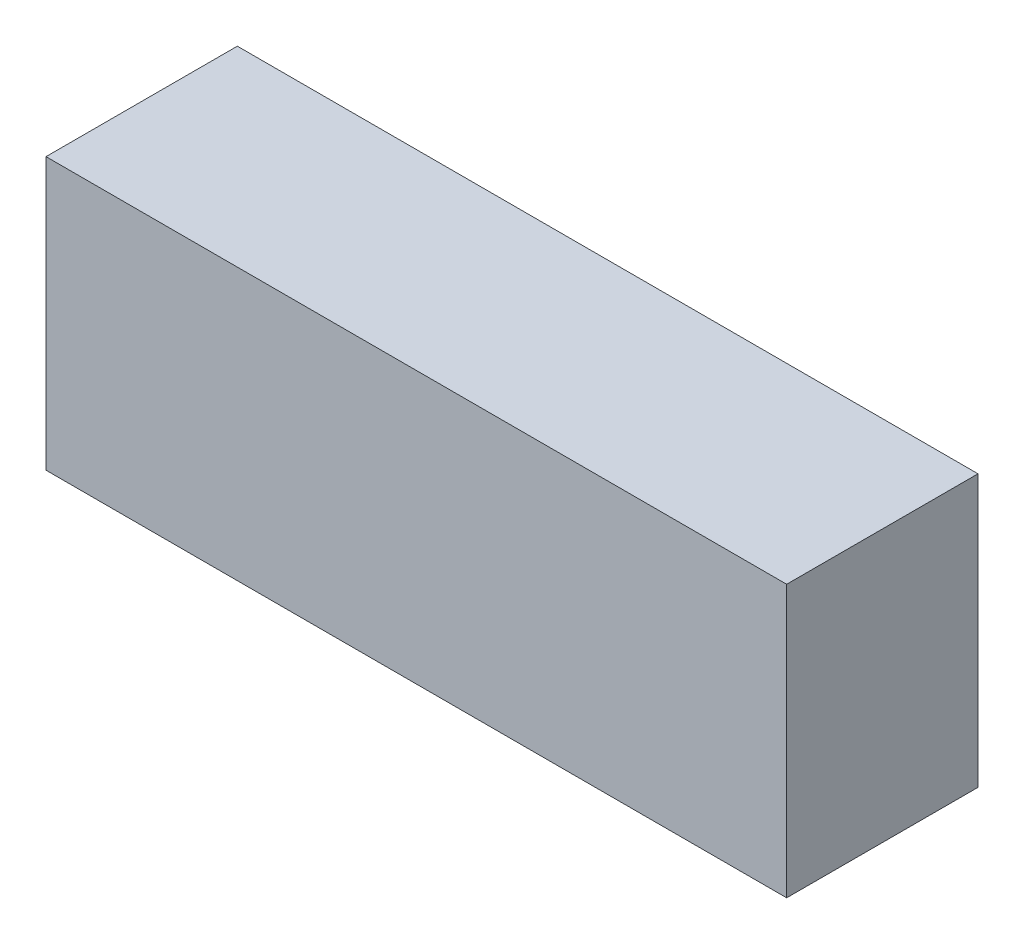
ISO-10303-21;
HEADER;
FILE_DESCRIPTION(('STEP AP214'),'2;1');
FILE_NAME('part.step','',(''),(''),'','','');
FILE_SCHEMA(('AUTOMOTIVE_DESIGN { 1 0 10303 214 1 1 1 1 }'));
ENDSEC;
DATA;
#1=APPLICATION_CONTEXT('core data for automotive mechanical design processes');
#2=APPLICATION_PROTOCOL_DEFINITION('international standard','automotive_design',2000,#1);
#3=PRODUCT_CONTEXT('',#1,'mechanical');
#4=PRODUCT('Part','Part','',(#3));
#5=PRODUCT_RELATED_PRODUCT_CATEGORY('part','',(#4));
#6=PRODUCT_DEFINITION_FORMATION('','',#4);
#7=PRODUCT_DEFINITION_CONTEXT('part definition',#1,'design');
#8=PRODUCT_DEFINITION('design','',#6,#7);
#9=PRODUCT_DEFINITION_SHAPE('','',#8);
#10=(LENGTH_UNIT() NAMED_UNIT(*) SI_UNIT(.MILLI.,.METRE.));
#11=(NAMED_UNIT(*) PLANE_ANGLE_UNIT() SI_UNIT($,.RADIAN.));
#12=(NAMED_UNIT(*) SI_UNIT($,.STERADIAN.) SOLID_ANGLE_UNIT());
#13=UNCERTAINTY_MEASURE_WITH_UNIT(LENGTH_MEASURE(1.E-05),#10,'distance_accuracy_value','');
#14=(GEOMETRIC_REPRESENTATION_CONTEXT(3) GLOBAL_UNCERTAINTY_ASSIGNED_CONTEXT((#13)) GLOBAL_UNIT_ASSIGNED_CONTEXT((#10,
#11,#12)) REPRESENTATION_CONTEXT('',''));
#15=CARTESIAN_POINT('',(0.,0.,0.));
#16=DIRECTION('',(0.,0.,1.));
#17=DIRECTION('',(1.,0.,0.));
#18=AXIS2_PLACEMENT_3D('',#15,#16,#17);
#19=CARTESIAN_POINT('',(-0.9,1.02,0.31));
#20=DIRECTION('',(0.,0.,1.));
#21=DIRECTION('',(1.,0.,0.));
#22=AXIS2_PLACEMENT_3D('',#19,#20,#21);
#23=PLANE('',#22);
#24=DIRECTION('',(1.,0.,0.));
#25=VECTOR('',#24,1.);
#26=CARTESIAN_POINT('',(-0.9,1.02,0.31));
#27=LINE('',#26,#25);
#28=CARTESIAN_POINT('',(-0.9,1.02,0.31));
#29=VERTEX_POINT('',#28);
#30=CARTESIAN_POINT('',(0.3,1.02,0.31));
#31=VERTEX_POINT('',#30);
#32=EDGE_CURVE('E20',#29,#31,#27,.T.);
#33=ORIENTED_EDGE('',*,*,#32,.F.);
#34=DIRECTION('',(0.,-1.,0.));
#35=VECTOR('',#34,1.);
#36=CARTESIAN_POINT('',(-0.9,1.02,0.31));
#37=LINE('',#36,#35);
#38=CARTESIAN_POINT('',(-0.9,0.58,0.31));
#39=VERTEX_POINT('',#38);
#40=EDGE_CURVE('E74',#29,#39,#37,.T.);
#41=ORIENTED_EDGE('',*,*,#40,.T.);
#42=DIRECTION('',(1.,0.,0.));
#43=VECTOR('',#42,1.);
#44=CARTESIAN_POINT('',(-0.9,0.58,0.31));
#45=LINE('',#44,#43);
#46=CARTESIAN_POINT('',(0.3,0.58,0.31));
#47=VERTEX_POINT('',#46);
#48=EDGE_CURVE('E99',#39,#47,#45,.T.);
#49=ORIENTED_EDGE('',*,*,#48,.T.);
#50=DIRECTION('',(0.,-1.,0.));
#51=VECTOR('',#50,1.);
#52=CARTESIAN_POINT('',(0.3,1.02,0.31));
#53=LINE('',#52,#51);
#54=EDGE_CURVE('E11',#31,#47,#53,.T.);
#55=ORIENTED_EDGE('',*,*,#54,.F.);
#56=EDGE_LOOP('',(#33,#41,#49,#55));
#57=FACE_BOUND('',#56,.T.);
#58=ADVANCED_FACE('F16',(#57),#23,.T.);
#59=CARTESIAN_POINT('',(-0.9,1.02,0.));
#60=DIRECTION('',(0.,0.,1.));
#61=DIRECTION('',(1.,0.,0.));
#62=AXIS2_PLACEMENT_3D('',#59,#60,#61);
#63=PLANE('',#62);
#64=DIRECTION('',(1.,0.,0.));
#65=VECTOR('',#64,1.);
#66=CARTESIAN_POINT('',(-0.9,1.02,0.));
#67=LINE('',#66,#65);
#68=CARTESIAN_POINT('',(-0.9,1.02,0.));
#69=VERTEX_POINT('',#68);
#70=CARTESIAN_POINT('',(0.3,1.02,0.));
#71=VERTEX_POINT('',#70);
#72=EDGE_CURVE('E77',#69,#71,#67,.T.);
#73=ORIENTED_EDGE('',*,*,#72,.T.);
#74=DIRECTION('',(0.,-1.,0.));
#75=VECTOR('',#74,1.);
#76=CARTESIAN_POINT('',(0.3,1.02,0.));
#77=LINE('',#76,#75);
#78=CARTESIAN_POINT('',(0.3,0.58,0.));
#79=VERTEX_POINT('',#78);
#80=EDGE_CURVE('E27',#71,#79,#77,.T.);
#81=ORIENTED_EDGE('',*,*,#80,.T.);
#82=DIRECTION('',(1.,0.,0.));
#83=VECTOR('',#82,1.);
#84=CARTESIAN_POINT('',(-0.9,0.58,0.));
#85=LINE('',#84,#83);
#86=CARTESIAN_POINT('',(-0.9,0.58,0.));
#87=VERTEX_POINT('',#86);
#88=EDGE_CURVE('E100',#87,#79,#85,.T.);
#89=ORIENTED_EDGE('',*,*,#88,.F.);
#90=DIRECTION('',(0.,-1.,0.));
#91=VECTOR('',#90,1.);
#92=CARTESIAN_POINT('',(-0.9,1.02,0.));
#93=LINE('',#92,#91);
#94=EDGE_CURVE('E79',#69,#87,#93,.T.);
#95=ORIENTED_EDGE('',*,*,#94,.F.);
#96=EDGE_LOOP('',(#73,#81,#89,#95));
#97=FACE_BOUND('',#96,.T.);
#98=ADVANCED_FACE('F78',(#97),#63,.F.);
#99=CARTESIAN_POINT('',(0.3,1.02,0.));
#100=DIRECTION('',(1.,0.,0.));
#101=DIRECTION('',(0.,1.,0.));
#102=AXIS2_PLACEMENT_3D('',#99,#100,#101);
#103=PLANE('',#102);
#104=ORIENTED_EDGE('',*,*,#80,.F.);
#105=DIRECTION('',(0.,0.,1.));
#106=VECTOR('',#105,1.);
#107=CARTESIAN_POINT('',(0.3,1.02,0.));
#108=LINE('',#107,#106);
#109=EDGE_CURVE('E66',#71,#31,#108,.T.);
#110=ORIENTED_EDGE('',*,*,#109,.T.);
#111=ORIENTED_EDGE('',*,*,#54,.T.);
#112=DIRECTION('',(0.,0.,1.));
#113=VECTOR('',#112,1.);
#114=CARTESIAN_POINT('',(0.3,0.58,0.));
#115=LINE('',#114,#113);
#116=EDGE_CURVE('E69',#79,#47,#115,.T.);
#117=ORIENTED_EDGE('',*,*,#116,.F.);
#118=EDGE_LOOP('',(#104,#110,#111,#117));
#119=FACE_BOUND('',#118,.T.);
#120=ADVANCED_FACE('F64',(#119),#103,.T.);
#121=CARTESIAN_POINT('',(-0.9,1.02,0.));
#122=DIRECTION('',(1.,0.,0.));
#123=DIRECTION('',(0.,1.,0.));
#124=AXIS2_PLACEMENT_3D('',#121,#122,#123);
#125=PLANE('',#124);
#126=ORIENTED_EDGE('',*,*,#94,.T.);
#127=DIRECTION('',(0.,0.,1.));
#128=VECTOR('',#127,1.);
#129=CARTESIAN_POINT('',(-0.9,0.58,0.));
#130=LINE('',#129,#128);
#131=EDGE_CURVE('E84',#87,#39,#130,.T.);
#132=ORIENTED_EDGE('',*,*,#131,.T.);
#133=ORIENTED_EDGE('',*,*,#40,.F.);
#134=DIRECTION('',(0.,0.,1.));
#135=VECTOR('',#134,1.);
#136=CARTESIAN_POINT('',(-0.9,1.02,0.));
#137=LINE('',#136,#135);
#138=EDGE_CURVE('E93',#69,#29,#137,.T.);
#139=ORIENTED_EDGE('',*,*,#138,.F.);
#140=EDGE_LOOP('',(#126,#132,#133,#139));
#141=FACE_BOUND('',#140,.T.);
#142=ADVANCED_FACE('F122',(#141),#125,.F.);
#143=CARTESIAN_POINT('',(-0.9,0.58,0.));
#144=DIRECTION('',(0.,-1.,0.));
#145=DIRECTION('',(0.,0.,-1.));
#146=AXIS2_PLACEMENT_3D('',#143,#144,#145);
#147=PLANE('',#146);
#148=ORIENTED_EDGE('',*,*,#131,.F.);
#149=ORIENTED_EDGE('',*,*,#88,.T.);
#150=ORIENTED_EDGE('',*,*,#116,.T.);
#151=ORIENTED_EDGE('',*,*,#48,.F.);
#152=EDGE_LOOP('',(#148,#149,#150,#151));
#153=FACE_BOUND('',#152,.T.);
#154=ADVANCED_FACE('F112',(#153),#147,.T.);
#155=CARTESIAN_POINT('',(-0.9,1.02,0.));
#156=DIRECTION('',(0.,-1.,0.));
#157=DIRECTION('',(0.,0.,-1.));
#158=AXIS2_PLACEMENT_3D('',#155,#156,#157);
#159=PLANE('',#158);
#160=ORIENTED_EDGE('',*,*,#138,.T.);
#161=ORIENTED_EDGE('',*,*,#32,.T.);
#162=ORIENTED_EDGE('',*,*,#109,.F.);
#163=ORIENTED_EDGE('',*,*,#72,.F.);
#164=EDGE_LOOP('',(#160,#161,#162,#163));
#165=FACE_BOUND('',#164,.T.);
#166=ADVANCED_FACE('F18',(#165),#159,.F.);
#167=CLOSED_SHELL('',(#58,#98,#120,#142,#154,#166));
#168=MANIFOLD_SOLID_BREP('B1',#167);
#169=ADVANCED_BREP_SHAPE_REPRESENTATION('',(#18,#168),#14);
#170=SHAPE_DEFINITION_REPRESENTATION(#9,#169);
ENDSEC;
END-ISO-10303-21;
